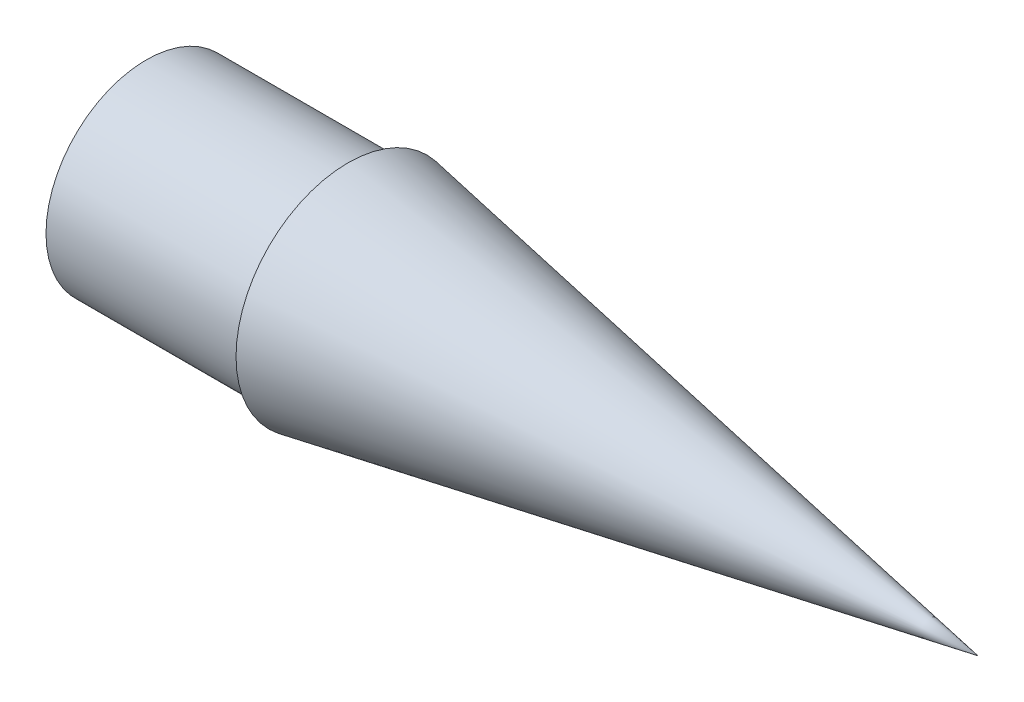
ISO-10303-21;
HEADER;
FILE_DESCRIPTION(('STEP AP214'),'2;1');
FILE_NAME('part.step','',(''),(''),'','','');
FILE_SCHEMA(('AUTOMOTIVE_DESIGN { 1 0 10303 214 1 1 1 1 }'));
ENDSEC;
DATA;
#1=APPLICATION_CONTEXT('core data for automotive mechanical design processes');
#2=APPLICATION_PROTOCOL_DEFINITION('international standard','automotive_design',2000,#1);
#3=PRODUCT_CONTEXT('',#1,'mechanical');
#4=PRODUCT('Part','Part','',(#3));
#5=PRODUCT_RELATED_PRODUCT_CATEGORY('part','',(#4));
#6=PRODUCT_DEFINITION_FORMATION('','',#4);
#7=PRODUCT_DEFINITION_CONTEXT('part definition',#1,'design');
#8=PRODUCT_DEFINITION('design','',#6,#7);
#9=PRODUCT_DEFINITION_SHAPE('','',#8);
#10=(LENGTH_UNIT() NAMED_UNIT(*) SI_UNIT(.MILLI.,.METRE.));
#11=(NAMED_UNIT(*) PLANE_ANGLE_UNIT() SI_UNIT($,.RADIAN.));
#12=(NAMED_UNIT(*) SI_UNIT($,.STERADIAN.) SOLID_ANGLE_UNIT());
#13=UNCERTAINTY_MEASURE_WITH_UNIT(LENGTH_MEASURE(1.E-05),#10,'distance_accuracy_value','');
#14=(GEOMETRIC_REPRESENTATION_CONTEXT(3) GLOBAL_UNCERTAINTY_ASSIGNED_CONTEXT((#13)) GLOBAL_UNIT_ASSIGNED_CONTEXT((#10,
#11,#12)) REPRESENTATION_CONTEXT('',''));
#15=CARTESIAN_POINT('',(0.,0.,0.));
#16=DIRECTION('',(0.,0.,1.));
#17=DIRECTION('',(1.,0.,0.));
#18=AXIS2_PLACEMENT_3D('',#15,#16,#17);
#19=CARTESIAN_POINT('',(209.55,0.,0.));
#20=DIRECTION('',(-1.,0.,0.));
#21=DIRECTION('',(0.,0.,1.));
#22=AXIS2_PLACEMENT_3D('',#19,#20,#21);
#23=CONICAL_SURFACE('',#22,0.,0.175767288915441);
#24=CARTESIAN_POINT('',(50.8,0.,0.));
#25=DIRECTION('',(-1.,0.,0.));
#26=DIRECTION('',(0.,0.,1.));
#27=AXIS2_PLACEMENT_3D('',#24,#25,#26);
#28=CIRCLE('',#27,28.194);
#29=CARTESIAN_POINT('',(50.8,0.,28.194));
#30=VERTEX_POINT('',#29);
#31=EDGE_CURVE('E11',#30,#30,#28,.T.);
#32=ORIENTED_EDGE('',*,*,#31,.F.);
#33=EDGE_LOOP('',(#32));
#34=FACE_BOUND('',#33,.T.);
#35=CARTESIAN_POINT('',(209.55,0.,0.));
#36=VERTEX_POINT('',#35);
#37=VERTEX_LOOP('',#36);
#38=FACE_BOUND('',#37,.T.);
#39=ADVANCED_FACE('F37',(#34,#38),#23,.T.);
#40=CARTESIAN_POINT('',(50.8,0.,-25.273));
#41=DIRECTION('',(1.,0.,0.));
#42=DIRECTION('',(0.,0.,-1.));
#43=AXIS2_PLACEMENT_3D('',#40,#41,#42);
#44=PLANE('',#43);
#45=CARTESIAN_POINT('',(50.8,0.,0.));
#46=DIRECTION('',(-1.,0.,0.));
#47=DIRECTION('',(0.,0.,1.));
#48=AXIS2_PLACEMENT_3D('',#45,#46,#47);
#49=CIRCLE('',#48,25.273);
#50=CARTESIAN_POINT('',(50.8,0.,25.273));
#51=VERTEX_POINT('',#50);
#52=EDGE_CURVE('E44',#51,#51,#49,.T.);
#53=ORIENTED_EDGE('',*,*,#52,.F.);
#54=EDGE_LOOP('',(#53));
#55=FACE_BOUND('',#54,.T.);
#56=ORIENTED_EDGE('',*,*,#31,.T.);
#57=EDGE_LOOP('',(#56));
#58=FACE_BOUND('',#57,.T.);
#59=ADVANCED_FACE('F68',(#55,#58),#44,.F.);
#60=CARTESIAN_POINT('',(0.,0.,0.));
#61=DIRECTION('',(-1.,0.,0.));
#62=DIRECTION('',(0.,0.,1.));
#63=AXIS2_PLACEMENT_3D('',#60,#61,#62);
#64=CYLINDRICAL_SURFACE('',#63,25.273);
#65=CARTESIAN_POINT('',(0.,0.,0.));
#66=DIRECTION('',(-1.,0.,0.));
#67=DIRECTION('',(0.,0.,1.));
#68=AXIS2_PLACEMENT_3D('',#65,#66,#67);
#69=CIRCLE('',#68,25.273);
#70=CARTESIAN_POINT('',(0.,0.,25.273));
#71=VERTEX_POINT('',#70);
#72=EDGE_CURVE('E96',#71,#71,#69,.T.);
#73=ORIENTED_EDGE('',*,*,#72,.F.);
#74=EDGE_LOOP('',(#73));
#75=FACE_BOUND('',#74,.T.);
#76=ORIENTED_EDGE('',*,*,#52,.T.);
#77=EDGE_LOOP('',(#76));
#78=FACE_BOUND('',#77,.T.);
#79=ADVANCED_FACE('F63',(#75,#78),#64,.T.);
#80=CARTESIAN_POINT('',(0.,0.,0.));
#81=DIRECTION('',(1.,0.,0.));
#82=DIRECTION('',(0.,0.,-1.));
#83=AXIS2_PLACEMENT_3D('',#80,#81,#82);
#84=PLANE('',#83);
#85=CARTESIAN_POINT('',(0.,0.,0.));
#86=DIRECTION('',(1.,0.,0.));
#87=DIRECTION('',(0.,0.,-1.));
#88=AXIS2_PLACEMENT_3D('',#85,#86,#87);
#89=CIRCLE('',#88,22.733);
#90=CARTESIAN_POINT('',(0.,0.,-22.733));
#91=VERTEX_POINT('',#90);
#92=EDGE_CURVE('E90',#91,#91,#89,.F.);
#93=ORIENTED_EDGE('',*,*,#92,.F.);
#94=EDGE_LOOP('',(#93));
#95=FACE_BOUND('',#94,.T.);
#96=ORIENTED_EDGE('',*,*,#72,.T.);
#97=EDGE_LOOP('',(#96));
#98=FACE_BOUND('',#97,.T.);
#99=ADVANCED_FACE('F53',(#95,#98),#84,.F.);
#100=CARTESIAN_POINT('',(195.024397266274,0.,0.));
#101=DIRECTION('',(-1.,0.,0.));
#102=DIRECTION('',(0.,0.,1.));
#103=AXIS2_PLACEMENT_3D('',#100,#101,#102);
#104=CONICAL_SURFACE('',#103,0.,0.175767288915441);
#105=CARTESIAN_POINT('',(53.34,0.,0.));
#106=DIRECTION('',(1.,0.,0.));
#107=DIRECTION('',(0.,0.,-1.));
#108=AXIS2_PLACEMENT_3D('',#105,#106,#107);
#109=CIRCLE('',#108,25.1631489544903);
#110=CARTESIAN_POINT('',(53.34,0.,-25.1631489544903));
#111=VERTEX_POINT('',#110);
#112=EDGE_CURVE('E94',#111,#111,#109,.F.);
#113=ORIENTED_EDGE('',*,*,#112,.T.);
#114=EDGE_LOOP('',(#113));
#115=FACE_BOUND('',#114,.T.);
#116=CARTESIAN_POINT('',(195.024397266274,0.,0.));
#117=VERTEX_POINT('',#116);
#118=VERTEX_LOOP('',#117);
#119=FACE_BOUND('',#118,.T.);
#120=ADVANCED_FACE('F50',(#115,#119),#104,.F.);
#121=CARTESIAN_POINT('',(53.34,0.,-25.273));
#122=DIRECTION('',(1.,0.,0.));
#123=DIRECTION('',(0.,0.,-1.));
#124=AXIS2_PLACEMENT_3D('',#121,#122,#123);
#125=PLANE('',#124);
#126=CARTESIAN_POINT('',(53.34,0.,0.));
#127=DIRECTION('',(1.,0.,0.));
#128=DIRECTION('',(0.,0.,-1.));
#129=AXIS2_PLACEMENT_3D('',#126,#127,#128);
#130=CIRCLE('',#129,22.733);
#131=CARTESIAN_POINT('',(53.34,0.,-22.733));
#132=VERTEX_POINT('',#131);
#133=EDGE_CURVE('E93',#132,#132,#130,.F.);
#134=ORIENTED_EDGE('',*,*,#133,.T.);
#135=EDGE_LOOP('',(#134));
#136=FACE_BOUND('',#135,.T.);
#137=ORIENTED_EDGE('',*,*,#112,.F.);
#138=EDGE_LOOP('',(#137));
#139=FACE_BOUND('',#138,.T.);
#140=ADVANCED_FACE('F52',(#136,#139),#125,.T.);
#141=CARTESIAN_POINT('',(0.,0.,0.));
#142=DIRECTION('',(-1.,0.,0.));
#143=DIRECTION('',(0.,0.,1.));
#144=AXIS2_PLACEMENT_3D('',#141,#142,#143);
#145=CYLINDRICAL_SURFACE('',#144,22.733);
#146=ORIENTED_EDGE('',*,*,#92,.T.);
#147=EDGE_LOOP('',(#146));
#148=FACE_BOUND('',#147,.T.);
#149=ORIENTED_EDGE('',*,*,#133,.F.);
#150=EDGE_LOOP('',(#149));
#151=FACE_BOUND('',#150,.T.);
#152=ADVANCED_FACE('F60',(#148,#151),#145,.F.);
#153=CLOSED_SHELL('',(#39,#59,#79,#99,#120,#140,#152));
#154=MANIFOLD_SOLID_BREP('B2',#153);
#155=ADVANCED_BREP_SHAPE_REPRESENTATION('',(#18,#154),#14);
#156=SHAPE_DEFINITION_REPRESENTATION(#9,#155);
ENDSEC;
END-ISO-10303-21;
